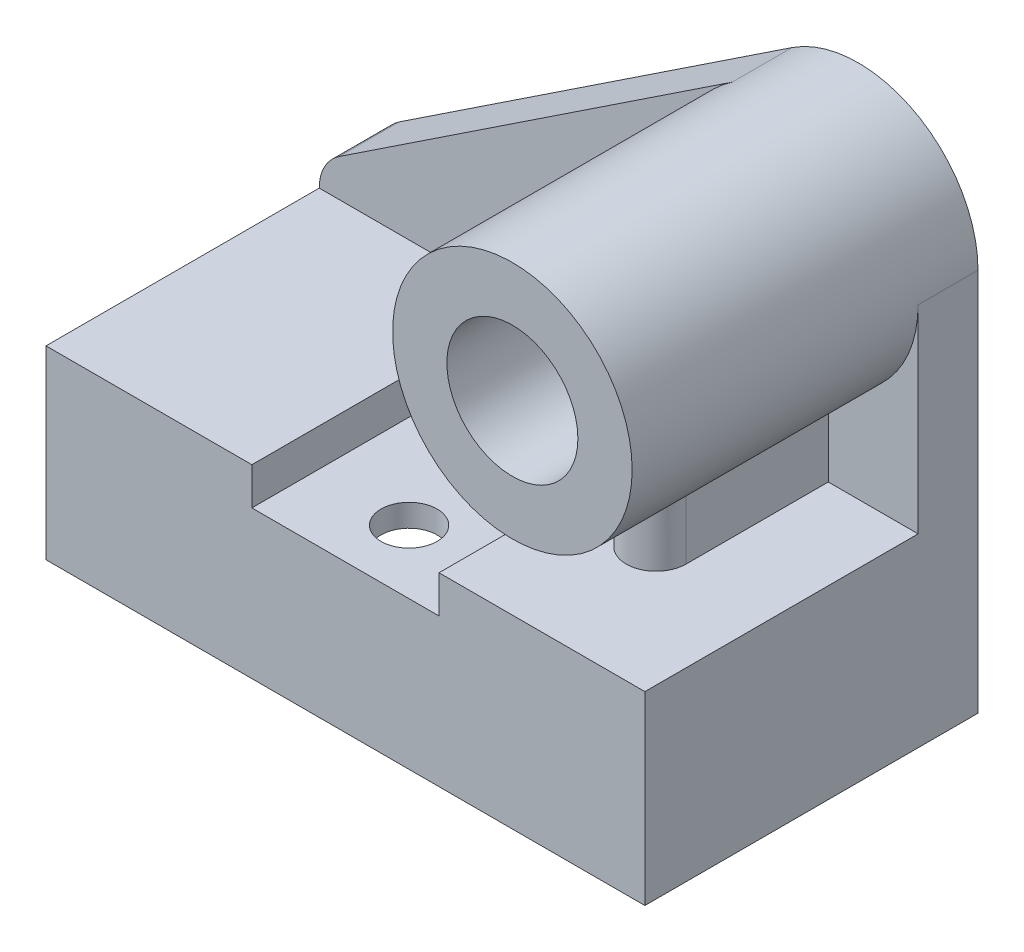
ISO-10303-21;
HEADER;
FILE_DESCRIPTION(('STEP AP214'),'2;1');
FILE_NAME('part.step','',(''),(''),'','','');
FILE_SCHEMA(('AUTOMOTIVE_DESIGN { 1 0 10303 214 1 1 1 1 }'));
ENDSEC;
DATA;
#1=APPLICATION_CONTEXT('core data for automotive mechanical design processes');
#2=APPLICATION_PROTOCOL_DEFINITION('international standard','automotive_design',2000,#1);
#3=PRODUCT_CONTEXT('',#1,'mechanical');
#4=PRODUCT('Part','Part','',(#3));
#5=PRODUCT_RELATED_PRODUCT_CATEGORY('part','',(#4));
#6=PRODUCT_DEFINITION_FORMATION('','',#4);
#7=PRODUCT_DEFINITION_CONTEXT('part definition',#1,'design');
#8=PRODUCT_DEFINITION('design','',#6,#7);
#9=PRODUCT_DEFINITION_SHAPE('','',#8);
#10=(LENGTH_UNIT() NAMED_UNIT(*) SI_UNIT(.MILLI.,.METRE.));
#11=(NAMED_UNIT(*) PLANE_ANGLE_UNIT() SI_UNIT($,.RADIAN.));
#12=(NAMED_UNIT(*) SI_UNIT($,.STERADIAN.) SOLID_ANGLE_UNIT());
#13=UNCERTAINTY_MEASURE_WITH_UNIT(LENGTH_MEASURE(1.E-05),#10,'distance_accuracy_value','');
#14=(GEOMETRIC_REPRESENTATION_CONTEXT(3) GLOBAL_UNCERTAINTY_ASSIGNED_CONTEXT((#13)) GLOBAL_UNIT_ASSIGNED_CONTEXT((#10,
#11,#12)) REPRESENTATION_CONTEXT('',''));
#15=CARTESIAN_POINT('',(0.,0.,0.));
#16=DIRECTION('',(0.,0.,1.));
#17=DIRECTION('',(1.,0.,0.));
#18=AXIS2_PLACEMENT_3D('',#15,#16,#17);
#19=CARTESIAN_POINT('',(-32.,102.5,92.4));
#20=DIRECTION('',(0.,0.,-1.));
#21=DIRECTION('',(-1.,0.,0.));
#22=AXIS2_PLACEMENT_3D('',#19,#20,#21);
#23=CYLINDRICAL_SURFACE('',#22,32.);
#24=CARTESIAN_POINT('',(-32.,102.5,92.4));
#25=DIRECTION('',(0.,0.,1.));
#26=DIRECTION('',(1.,0.,0.));
#27=AXIS2_PLACEMENT_3D('',#24,#25,#26);
#28=CIRCLE('',#27,32.);
#29=CARTESIAN_POINT('',(0.,102.5,92.4));
#30=VERTEX_POINT('',#29);
#31=EDGE_CURVE('E11',#30,#30,#28,.T.);
#32=ORIENTED_EDGE('',*,*,#31,.F.);
#33=EDGE_LOOP('',(#32));
#34=FACE_BOUND('',#33,.T.);
#35=DIRECTION('',(0.,0.,-1.));
#36=VECTOR('',#35,1.);
#37=CARTESIAN_POINT('',(-49.6982450307983,129.160309878728,16.));
#38=LINE('',#37,#36);
#39=CARTESIAN_POINT('',(-49.6982450307983,129.160309878728,16.));
#40=VERTEX_POINT('',#39);
#41=CARTESIAN_POINT('',(-49.6982450307983,129.160309878728,0.));
#42=VERTEX_POINT('',#41);
#43=EDGE_CURVE('E56',#40,#42,#38,.T.);
#44=ORIENTED_EDGE('',*,*,#43,.F.);
#45=CARTESIAN_POINT('',(-32.,102.5,16.));
#46=DIRECTION('',(0.,0.,1.));
#47=DIRECTION('',(1.,0.,0.));
#48=AXIS2_PLACEMENT_3D('',#45,#46,#47);
#49=CIRCLE('',#48,32.);
#50=CARTESIAN_POINT('',(-40.,71.5161332303407,16.));
#51=VERTEX_POINT('',#50);
#52=EDGE_CURVE('E60',#40,#51,#49,.T.);
#53=ORIENTED_EDGE('',*,*,#52,.T.);
#54=DIRECTION('',(0.,0.,-1.));
#55=VECTOR('',#54,1.);
#56=CARTESIAN_POINT('',(-40.,71.5161332303407,92.4));
#57=LINE('',#56,#55);
#58=CARTESIAN_POINT('',(-40.,71.5161332303611,54.));
#59=VERTEX_POINT('',#58);
#60=EDGE_CURVE('E260',#51,#59,#57,.F.);
#61=ORIENTED_EDGE('',*,*,#60,.T.);
#62=CARTESIAN_POINT('',(-40.,71.5161332303611,54.));
#63=CARTESIAN_POINT('',(-40.0000280544337,71.516158745682,54.2212367206058));
#64=CARTESIAN_POINT('',(-39.9908239351687,71.5137645196414,54.4424645268475));
#65=CARTESIAN_POINT('',(-39.9541576891331,71.5043223033306,54.8832658540761));
#66=CARTESIAN_POINT('',(-39.9266986346481,71.4972750961532,55.1028396471438));
#67=CARTESIAN_POINT('',(-39.8538008083666,71.4787308558009,55.538341411734));
#68=CARTESIAN_POINT('',(-39.8083976637214,71.4672426410215,55.7542757288307));
#69=CARTESIAN_POINT('',(-39.6999971091686,71.4401676916371,56.1814188182674));
#70=CARTESIAN_POINT('',(-39.636999457304,71.4245809006693,56.3926275255785));
#71=CARTESIAN_POINT('',(-39.4939356762478,71.3897712214484,56.8087955476442));
#72=CARTESIAN_POINT('',(-39.4138748988318,71.3705494734963,57.0137567989004));
#73=CARTESIAN_POINT('',(-39.2372546288073,71.3290139022866,57.4162045984616));
#74=CARTESIAN_POINT('',(-39.140689036432,71.3066989364313,57.6136883501899));
#75=CARTESIAN_POINT('',(-38.9317805865998,71.2596114504409,57.9998258652688));
#76=CARTESIAN_POINT('',(-38.8194371413712,71.2348388387614,58.1884792993148));
#77=CARTESIAN_POINT('',(-38.5797532806097,71.1835209139501,58.5557585768954));
#78=CARTESIAN_POINT('',(-38.4524122001394,71.1569755222427,58.7343839753067));
#79=CARTESIAN_POINT('',(-38.1809363558274,71.1022999736736,59.0838909661983));
#80=CARTESIAN_POINT('',(-38.0365203413901,71.0741489065014,59.2545508902197));
#81=CARTESIAN_POINT('',(-37.7339467017269,71.0175360184009,59.5831659166973));
#82=CARTESIAN_POINT('',(-37.5757889067169,70.9890741936369,59.7411208621329));
#83=CARTESIAN_POINT('',(-37.2467396218354,70.9326183126732,60.0433127794055));
#84=CARTESIAN_POINT('',(-37.0758459377881,70.9046243380978,60.1875473776721));
#85=CARTESIAN_POINT('',(-36.7224652126531,70.8498770188942,60.461290458239));
#86=CARTESIAN_POINT('',(-36.5399784852511,70.8231236407318,60.5907993387247));
#87=CARTESIAN_POINT('',(-36.1619325333859,70.7712239960298,60.8359186007419));
#88=CARTESIAN_POINT('',(-35.9662245759876,70.7461059150704,60.9513057318813));
#89=CARTESIAN_POINT('',(-35.5655134570821,70.6986195421177,61.1651004045434));
#90=CARTESIAN_POINT('',(-35.3605136652597,70.6762502640209,61.2635140402682));
#91=CARTESIAN_POINT('',(-34.9425827474529,70.634889048357,61.4426403045277));
#92=CARTESIAN_POINT('',(-34.7296514424177,70.6158971870897,61.5233525331767));
#93=CARTESIAN_POINT('',(-34.2973992920391,70.5818398364787,61.6664058886466));
#94=CARTESIAN_POINT('',(-34.0780785956853,70.566774255662,61.7287474434642));
#95=CARTESIAN_POINT('',(-33.6391620499081,70.5412689566385,61.8334549460496));
#96=CARTESIAN_POINT('',(-33.4196616021837,70.5307417887523,61.8761996351205));
#97=CARTESIAN_POINT('',(-32.9776884633137,70.5141746551768,61.9431781232991));
#98=CARTESIAN_POINT('',(-32.7552158372076,70.5081345914603,61.9674123267952));
#99=CARTESIAN_POINT('',(-32.3089675426713,70.5007135691066,61.9971582510348));
#100=CARTESIAN_POINT('',(-32.085192009084,70.4993321366233,62.0026718759161));
#101=CARTESIAN_POINT('',(-31.637987545708,70.5012665346051,61.9949332711412));
#102=CARTESIAN_POINT('',(-31.4145586116507,70.5045823067545,61.9816812744597));
#103=CARTESIAN_POINT('',(-30.9747001518449,70.5156901447709,61.9370353075323));
#104=CARTESIAN_POINT('',(-30.7582259623917,70.5233802543781,61.9060544622544));
#105=CARTESIAN_POINT('',(-30.3286493946472,70.5429533028099,61.8265138220336));
#106=CARTESIAN_POINT('',(-30.1155481814017,70.5548376586973,61.7779480857372));
#107=CARTESIAN_POINT('',(-29.6943374596585,70.5824741604891,61.6636496834091));
#108=CARTESIAN_POINT('',(-29.4862263087893,70.5982250140931,61.5979227527013));
#109=CARTESIAN_POINT('',(-29.0762467862461,70.6331831779632,61.4497781070814));
#110=CARTESIAN_POINT('',(-28.8743807820437,70.6523917806588,61.3673541497441));
#111=CARTESIAN_POINT('',(-28.4765754723538,70.6939341672795,61.1856600001906));
#112=CARTESIAN_POINT('',(-28.2807028117609,70.7162936282113,61.0862498056194));
#113=CARTESIAN_POINT('',(-27.8979434976561,70.7634227888494,60.8717739246116));
#114=CARTESIAN_POINT('',(-27.7110599694918,70.7881933179155,60.7567028456821));
#115=CARTESIAN_POINT('',(-27.3475457426236,70.8394825314385,60.5117359543025));
#116=CARTESIAN_POINT('',(-27.1709145359932,70.8660011291524,60.3818408772191));
#117=CARTESIAN_POINT('',(-26.8289984385661,70.9200901205802,60.1080854429683));
#118=CARTESIAN_POINT('',(-26.6637137727223,70.9476605351305,59.9642248090607));
#119=CARTESIAN_POINT('',(-26.3412000317921,71.003881125021,59.6593768187564));
#120=CARTESIAN_POINT('',(-26.1843117261326,71.0325402875742,59.4980303916783));
#121=CARTESIAN_POINT('',(-25.8846941538753,71.089392158551,59.1627097005253));
#122=CARTESIAN_POINT('',(-25.7419602168071,71.1175850182635,58.9887396348636));
#123=CARTESIAN_POINT('',(-25.4714768375941,71.1727362384378,58.6291503654458));
#124=CARTESIAN_POINT('',(-25.3437371476937,71.1996937885842,58.4435236993857));
#125=CARTESIAN_POINT('',(-25.1043016690472,71.2515704281193,58.0620243779298));
#126=CARTESIAN_POINT('',(-24.9925997067108,71.2764903002964,57.8661557049331));
#127=CARTESIAN_POINT('',(-24.7854078774411,71.3237105639005,57.4642558402384));
#128=CARTESIAN_POINT('',(-24.6900160490465,71.3459948823797,57.2581721820048));
#129=CARTESIAN_POINT('',(-24.5170290029085,71.3870918818633,56.8384239105144));
#130=CARTESIAN_POINT('',(-24.4394266834676,71.405905947629,56.6247623618769));
#131=CARTESIAN_POINT('',(-24.302684208487,71.4394737900285,56.1915453546083));
#132=CARTESIAN_POINT('',(-24.2435249358262,71.4542317691029,55.9719962568803));
#133=CARTESIAN_POINT('',(-24.1440918012067,71.4792435266469,55.5285021173662));
#134=CARTESIAN_POINT('',(-24.1038090916045,71.4894994151509,55.3045591864006));
#135=CARTESIAN_POINT('',(-24.0487808623285,71.503568496023,54.90038804313));
#136=CARTESIAN_POINT('',(-24.0304826367573,71.5082740323943,54.7206658998328));
#137=CARTESIAN_POINT('',(-24.0060969884818,71.5145591208553,54.3606341934799));
#138=CARTESIAN_POINT('',(-23.9999898098604,71.5161437304345,54.1803260558676));
#139=CARTESIAN_POINT('',(-24.,71.5161332303407,53.9999999999993));
#140=B_SPLINE_CURVE_WITH_KNOTS('',3,(#62,#63,#64,#65,#66,#67,#68,#69,#70,#71,#72,#73,#74,#75,
#76,#77,#78,#79,#80,#81,#82,#83,#84,#85,#86,#87,#88,#89,#90,#91,#92,#93,#94,#95,#96,#97,#98,#99,
#100,#101,#102,#103,#104,#105,#106,#107,#108,#109,#110,#111,#112,#113,#114,#115,#116,#117,#118,
#119,#120,#121,#122,#123,#124,#125,#126,#127,#128,#129,#130,#131,#132,#133,#134,#135,#136,#137,
#138,#139),.UNSPECIFIED.,.F.,.F.,(4,2,2,2,2,2,2,2,2,2,2,2,2,2,2,2,2,2,2,2,2,2,2,2,2,2,2,2,2,2,2,
2,2,2,2,2,2,2,4),(0.,0.663492242717754,1.32687284867662,1.98894290744224,2.65102207134075,
3.31289388176644,3.97501083448075,4.63715245955544,5.29932345249751,5.97452992833415,
6.64974474775131,7.32507616525506,8.00038931735198,8.68528336807323,9.36993099864893,
10.0545940942485,10.7392412374291,11.4100321538676,12.0808084154889,12.7515164479815,
13.4222161537266,14.0778887695744,14.7337831225543,15.3894585535814,16.0453795722873,
16.7069934346376,17.3688356887719,18.0306451254819,18.6924676792265,19.372267461451,
20.0518421807395,20.7318564740573,21.4116082956317,22.0953124116701,22.7787431110354,
23.4614630273386,24.143862624779,24.6855747194271,25.2264082401843),.UNSPECIFIED.);
#141=CARTESIAN_POINT('',(-24.,71.5161332303407,54.));
#142=VERTEX_POINT('',#141);
#143=EDGE_CURVE('E245',#59,#142,#140,.T.);
#144=ORIENTED_EDGE('',*,*,#143,.T.);
#145=DIRECTION('',(0.,0.,-1.));
#146=VECTOR('',#145,1.);
#147=CARTESIAN_POINT('',(-24.,71.5161332303407,92.4));
#148=LINE('',#147,#146);
#149=CARTESIAN_POINT('',(-24.,71.5161332303407,16.));
#150=VERTEX_POINT('',#149);
#151=EDGE_CURVE('E256',#150,#142,#148,.F.);
#152=ORIENTED_EDGE('',*,*,#151,.F.);
#153=CARTESIAN_POINT('',(0.,102.5,16.));
#154=VERTEX_POINT('',#153);
#155=EDGE_CURVE('E232',#150,#154,#49,.T.);
#156=ORIENTED_EDGE('',*,*,#155,.T.);
#157=DIRECTION('',(0.,0.,-1.));
#158=VECTOR('',#157,1.);
#159=CARTESIAN_POINT('',(0.,102.5,16.));
#160=LINE('',#159,#158);
#161=CARTESIAN_POINT('',(0.,102.5,0.));
#162=VERTEX_POINT('',#161);
#163=EDGE_CURVE('E228',#154,#162,#160,.T.);
#164=ORIENTED_EDGE('',*,*,#163,.T.);
#165=CARTESIAN_POINT('',(-32.,102.5,0.));
#166=DIRECTION('',(0.,0.,1.));
#167=DIRECTION('',(1.,0.,0.));
#168=AXIS2_PLACEMENT_3D('',#165,#166,#167);
#169=CIRCLE('',#168,32.);
#170=EDGE_CURVE('E43',#162,#42,#169,.T.);
#171=ORIENTED_EDGE('',*,*,#170,.T.);
#172=EDGE_LOOP('',(#44,#53,#61,#144,#152,#156,#164,#171));
#173=FACE_BOUND('',#172,.T.);
#174=ADVANCED_FACE('F39',(#34,#173),#23,.T.);
#175=CARTESIAN_POINT('',(-32.,102.5,92.4));
#176=DIRECTION('',(0.,0.,-1.));
#177=DIRECTION('',(-1.,0.,0.));
#178=AXIS2_PLACEMENT_3D('',#175,#176,#177);
#179=CYLINDRICAL_SURFACE('',#178,17.5);
#180=CARTESIAN_POINT('',(-32.,102.5,92.4));
#181=DIRECTION('',(0.,0.,1.));
#182=DIRECTION('',(1.,0.,0.));
#183=AXIS2_PLACEMENT_3D('',#180,#181,#182);
#184=CIRCLE('',#183,17.5);
#185=CARTESIAN_POINT('',(-14.5,102.5,92.4));
#186=VERTEX_POINT('',#185);
#187=EDGE_CURVE('E48',#186,#186,#184,.T.);
#188=ORIENTED_EDGE('',*,*,#187,.T.);
#189=EDGE_LOOP('',(#188));
#190=FACE_BOUND('',#189,.T.);
#191=CARTESIAN_POINT('',(-32.,102.5,0.));
#192=DIRECTION('',(0.,0.,1.));
#193=DIRECTION('',(1.,0.,0.));
#194=AXIS2_PLACEMENT_3D('',#191,#192,#193);
#195=CIRCLE('',#194,17.5);
#196=CARTESIAN_POINT('',(-14.5,102.5,0.));
#197=VERTEX_POINT('',#196);
#198=EDGE_CURVE('E531',#197,#197,#195,.T.);
#199=ORIENTED_EDGE('',*,*,#198,.F.);
#200=EDGE_LOOP('',(#199));
#201=FACE_BOUND('',#200,.T.);
#202=ADVANCED_FACE('F41',(#190,#201),#179,.F.);
#203=CARTESIAN_POINT('',(0.,0.,92.4));
#204=DIRECTION('',(0.,0.,1.));
#205=DIRECTION('',(1.,0.,0.));
#206=AXIS2_PLACEMENT_3D('',#203,#204,#205);
#207=PLANE('',#206);
#208=ORIENTED_EDGE('',*,*,#187,.F.);
#209=EDGE_LOOP('',(#208));
#210=FACE_BOUND('',#209,.T.);
#211=ORIENTED_EDGE('',*,*,#31,.T.);
#212=EDGE_LOOP('',(#211));
#213=FACE_BOUND('',#212,.T.);
#214=ADVANCED_FACE('F299',(#210,#213),#207,.T.);
#215=CARTESIAN_POINT('',(0.,0.,0.));
#216=DIRECTION('',(0.,0.,1.));
#217=DIRECTION('',(1.,0.,0.));
#218=AXIS2_PLACEMENT_3D('',#215,#216,#217);
#219=PLANE('',#218);
#220=ORIENTED_EDGE('',*,*,#198,.T.);
#221=EDGE_LOOP('',(#220));
#222=FACE_BOUND('',#221,.T.);
#223=ORIENTED_EDGE('',*,*,#170,.F.);
#224=DIRECTION('',(0.,1.,0.));
#225=VECTOR('',#224,1.);
#226=CARTESIAN_POINT('',(0.,0.,0.));
#227=LINE('',#226,#225);
#228=CARTESIAN_POINT('',(0.,0.,0.));
#229=VERTEX_POINT('',#228);
#230=EDGE_CURVE('E521',#229,#162,#227,.T.);
#231=ORIENTED_EDGE('',*,*,#230,.F.);
#232=DIRECTION('',(-1.,0.,0.));
#233=VECTOR('',#232,1.);
#234=CARTESIAN_POINT('',(0.,0.,0.));
#235=LINE('',#234,#233);
#236=CARTESIAN_POINT('',(-160.,0.,0.));
#237=VERTEX_POINT('',#236);
#238=EDGE_CURVE('E518',#229,#237,#235,.T.);
#239=ORIENTED_EDGE('',*,*,#238,.T.);
#240=DIRECTION('',(0.,1.,0.));
#241=VECTOR('',#240,1.);
#242=CARTESIAN_POINT('',(-160.,0.,0.));
#243=LINE('',#242,#241);
#244=CARTESIAN_POINT('',(-160.,49.5,0.));
#245=VERTEX_POINT('',#244);
#246=EDGE_CURVE('E495',#237,#245,#243,.T.);
#247=ORIENTED_EDGE('',*,*,#246,.T.);
#248=CARTESIAN_POINT('',(-148.,49.5,0.));
#249=DIRECTION('',(0.,0.,1.));
#250=DIRECTION('',(1.,0.,0.));
#251=AXIS2_PLACEMENT_3D('',#248,#249,#250);
#252=CIRCLE('',#251,12.);
#253=CARTESIAN_POINT('',(-154.636841886549,59.4976162045231,0.));
#254=VERTEX_POINT('',#253);
#255=EDGE_CURVE('E230',#245,#254,#252,.F.);
#256=ORIENTED_EDGE('',*,*,#255,.T.);
#257=DIRECTION('',(0.833134683710262,0.553070157212447,0.));
#258=VECTOR('',#257,1.);
#259=CARTESIAN_POINT('',(-74.716764068491,112.551955277792,0.));
#260=LINE('',#259,#258);
#261=EDGE_CURVE('E202',#254,#42,#260,.T.);
#262=ORIENTED_EDGE('',*,*,#261,.T.);
#263=EDGE_LOOP('',(#223,#231,#239,#247,#256,#262));
#264=FACE_BOUND('',#263,.T.);
#265=ADVANCED_FACE('F303',(#222,#264),#219,.F.);
#266=CARTESIAN_POINT('',(0.,49.5,89.));
#267=DIRECTION('',(0.,1.,0.));
#268=DIRECTION('',(-1.,0.,0.));
#269=AXIS2_PLACEMENT_3D('',#266,#267,#268);
#270=PLANE('',#269);
#271=DIRECTION('',(1.,0.,0.));
#272=VECTOR('',#271,1.);
#273=CARTESIAN_POINT('',(0.,49.5,16.));
#274=LINE('',#273,#272);
#275=CARTESIAN_POINT('',(-160.,49.5,16.));
#276=VERTEX_POINT('',#275);
#277=CARTESIAN_POINT('',(-40.,49.5,16.));
#278=VERTEX_POINT('',#277);
#279=EDGE_CURVE('E221',#276,#278,#274,.T.);
#280=ORIENTED_EDGE('',*,*,#279,.F.);
#281=DIRECTION('',(0.,0.,-1.));
#282=VECTOR('',#281,1.);
#283=CARTESIAN_POINT('',(-160.,49.5,89.));
#284=LINE('',#283,#282);
#285=CARTESIAN_POINT('',(-160.,49.5,89.));
#286=VERTEX_POINT('',#285);
#287=EDGE_CURVE('E528',#286,#276,#284,.T.);
#288=ORIENTED_EDGE('',*,*,#287,.F.);
#289=DIRECTION('',(1.,0.,0.));
#290=VECTOR('',#289,1.);
#291=CARTESIAN_POINT('',(0.,49.5,89.));
#292=LINE('',#291,#290);
#293=CARTESIAN_POINT('',(-105.,49.5,89.));
#294=VERTEX_POINT('',#293);
#295=EDGE_CURVE('E502',#286,#294,#292,.T.);
#296=ORIENTED_EDGE('',*,*,#295,.T.);
#297=DIRECTION('',(0.,0.,-1.));
#298=VECTOR('',#297,1.);
#299=CARTESIAN_POINT('',(-105.,49.5,0.));
#300=LINE('',#299,#298);
#301=CARTESIAN_POINT('',(-105.,49.5,35.));
#302=VERTEX_POINT('',#301);
#303=EDGE_CURVE('E476',#294,#302,#300,.T.);
#304=ORIENTED_EDGE('',*,*,#303,.T.);
#305=DIRECTION('',(1.,0.,0.));
#306=VECTOR('',#305,1.);
#307=CARTESIAN_POINT('',(0.,49.5,35.));
#308=LINE('',#307,#306);
#309=CARTESIAN_POINT('',(-55.,49.5,35.));
#310=VERTEX_POINT('',#309);
#311=EDGE_CURVE('E487',#302,#310,#308,.T.);
#312=ORIENTED_EDGE('',*,*,#311,.T.);
#313=DIRECTION('',(0.,0.,-1.));
#314=VECTOR('',#313,1.);
#315=CARTESIAN_POINT('',(-55.,49.5,0.));
#316=LINE('',#315,#314);
#317=CARTESIAN_POINT('',(-55.,49.5,89.));
#318=VERTEX_POINT('',#317);
#319=EDGE_CURVE('E435',#318,#310,#316,.T.);
#320=ORIENTED_EDGE('',*,*,#319,.F.);
#321=CARTESIAN_POINT('',(0.,49.5,89.));
#322=VERTEX_POINT('',#321);
#323=EDGE_CURVE('E506',#318,#322,#292,.T.);
#324=ORIENTED_EDGE('',*,*,#323,.T.);
#325=DIRECTION('',(0.,0.,-1.));
#326=VECTOR('',#325,1.);
#327=CARTESIAN_POINT('',(0.,49.5,89.));
#328=LINE('',#327,#326);
#329=CARTESIAN_POINT('',(0.,49.5,16.));
#330=VERTEX_POINT('',#329);
#331=EDGE_CURVE('E515',#322,#330,#328,.T.);
#332=ORIENTED_EDGE('',*,*,#331,.T.);
#333=CARTESIAN_POINT('',(-24.,49.5,16.));
#334=VERTEX_POINT('',#333);
#335=EDGE_CURVE('E218',#334,#330,#274,.T.);
#336=ORIENTED_EDGE('',*,*,#335,.F.);
#337=DIRECTION('',(0.,0.,1.));
#338=VECTOR('',#337,1.);
#339=CARTESIAN_POINT('',(-24.,49.5,0.));
#340=LINE('',#339,#338);
#341=CARTESIAN_POINT('',(-24.,49.5,54.));
#342=VERTEX_POINT('',#341);
#343=EDGE_CURVE('E246',#334,#342,#340,.T.);
#344=ORIENTED_EDGE('',*,*,#343,.T.);
#345=CARTESIAN_POINT('',(-32.,49.5,54.));
#346=DIRECTION('',(0.,1.,0.));
#347=DIRECTION('',(-1.,0.,0.));
#348=AXIS2_PLACEMENT_3D('',#345,#346,#347);
#349=CIRCLE('',#348,8.);
#350=CARTESIAN_POINT('',(-40.,49.5,54.));
#351=VERTEX_POINT('',#350);
#352=EDGE_CURVE('E248',#351,#342,#349,.T.);
#353=ORIENTED_EDGE('',*,*,#352,.F.);
#354=DIRECTION('',(0.,0.,1.));
#355=VECTOR('',#354,1.);
#356=CARTESIAN_POINT('',(-40.,49.5,0.));
#357=LINE('',#356,#355);
#358=EDGE_CURVE('E252',#278,#351,#357,.T.);
#359=ORIENTED_EDGE('',*,*,#358,.F.);
#360=EDGE_LOOP('',(#280,#288,#296,#304,#312,#320,#324,#332,#336,#344,#353,#359));
#361=FACE_BOUND('',#360,.T.);
#362=ADVANCED_FACE('F306',(#361),#270,.T.);
#363=CARTESIAN_POINT('',(0.,0.,89.));
#364=DIRECTION('',(0.,-1.,0.));
#365=DIRECTION('',(1.,0.,0.));
#366=AXIS2_PLACEMENT_3D('',#363,#364,#365);
#367=PLANE('',#366);
#368=ORIENTED_EDGE('',*,*,#238,.F.);
#369=DIRECTION('',(0.,0.,-1.));
#370=VECTOR('',#369,1.);
#371=CARTESIAN_POINT('',(0.,0.,89.));
#372=LINE('',#371,#370);
#373=CARTESIAN_POINT('',(0.,0.,89.));
#374=VERTEX_POINT('',#373);
#375=EDGE_CURVE('E524',#374,#229,#372,.T.);
#376=ORIENTED_EDGE('',*,*,#375,.F.);
#377=DIRECTION('',(-1.,0.,0.));
#378=VECTOR('',#377,1.);
#379=CARTESIAN_POINT('',(0.,0.,89.));
#380=LINE('',#379,#378);
#381=CARTESIAN_POINT('',(-160.,0.,89.));
#382=VERTEX_POINT('',#381);
#383=EDGE_CURVE('E509',#374,#382,#380,.T.);
#384=ORIENTED_EDGE('',*,*,#383,.T.);
#385=DIRECTION('',(0.,0.,-1.));
#386=VECTOR('',#385,1.);
#387=CARTESIAN_POINT('',(-160.,0.,89.));
#388=LINE('',#387,#386);
#389=EDGE_CURVE('E526',#382,#237,#388,.T.);
#390=ORIENTED_EDGE('',*,*,#389,.T.);
#391=EDGE_LOOP('',(#368,#376,#384,#390));
#392=FACE_BOUND('',#391,.T.);
#393=DIRECTION('',(0.,0.,-1.));
#394=VECTOR('',#393,1.);
#395=CARTESIAN_POINT('',(-6.,0.,89.));
#396=LINE('',#395,#394);
#397=CARTESIAN_POINT('',(-6.,0.,83.));
#398=VERTEX_POINT('',#397);
#399=CARTESIAN_POINT('',(-6.,0.,6.));
#400=VERTEX_POINT('',#399);
#401=EDGE_CURVE('E426',#398,#400,#396,.T.);
#402=ORIENTED_EDGE('',*,*,#401,.T.);
#403=DIRECTION('',(-1.,0.,0.));
#404=VECTOR('',#403,1.);
#405=CARTESIAN_POINT('',(0.,0.,6.00000000000001));
#406=LINE('',#405,#404);
#407=CARTESIAN_POINT('',(-154.,0.,6.));
#408=VERTEX_POINT('',#407);
#409=EDGE_CURVE('E454',#400,#408,#406,.T.);
#410=ORIENTED_EDGE('',*,*,#409,.T.);
#411=DIRECTION('',(0.,0.,-1.));
#412=VECTOR('',#411,1.);
#413=CARTESIAN_POINT('',(-154.,0.,89.));
#414=LINE('',#413,#412);
#415=CARTESIAN_POINT('',(-154.,0.,83.));
#416=VERTEX_POINT('',#415);
#417=EDGE_CURVE('E436',#416,#408,#414,.T.);
#418=ORIENTED_EDGE('',*,*,#417,.F.);
#419=DIRECTION('',(-1.,0.,0.));
#420=VECTOR('',#419,1.);
#421=CARTESIAN_POINT('',(0.,0.,83.));
#422=LINE('',#421,#420);
#423=EDGE_CURVE('E445',#398,#416,#422,.T.);
#424=ORIENTED_EDGE('',*,*,#423,.F.);
#425=EDGE_LOOP('',(#402,#410,#418,#424));
#426=FACE_BOUND('',#425,.T.);
#427=ADVANCED_FACE('F313',(#392,#426),#367,.T.);
#428=CARTESIAN_POINT('',(0.,0.,89.));
#429=DIRECTION('',(0.,0.,1.));
#430=DIRECTION('',(1.,0.,0.));
#431=AXIS2_PLACEMENT_3D('',#428,#429,#430);
#432=PLANE('',#431);
#433=DIRECTION('',(1.,0.,0.));
#434=VECTOR('',#433,1.);
#435=CARTESIAN_POINT('',(0.,39.5,89.));
#436=LINE('',#435,#434);
#437=CARTESIAN_POINT('',(-105.,39.5,89.));
#438=VERTEX_POINT('',#437);
#439=CARTESIAN_POINT('',(-55.,39.5,89.));
#440=VERTEX_POINT('',#439);
#441=EDGE_CURVE('E472',#438,#440,#436,.T.);
#442=ORIENTED_EDGE('',*,*,#441,.F.);
#443=DIRECTION('',(0.,1.,0.));
#444=VECTOR('',#443,1.);
#445=CARTESIAN_POINT('',(-105.,39.5,89.));
#446=LINE('',#445,#444);
#447=EDGE_CURVE('E492',#438,#294,#446,.T.);
#448=ORIENTED_EDGE('',*,*,#447,.T.);
#449=ORIENTED_EDGE('',*,*,#295,.F.);
#450=DIRECTION('',(0.,1.,0.));
#451=VECTOR('',#450,1.);
#452=CARTESIAN_POINT('',(-160.,0.,89.));
#453=LINE('',#452,#451);
#454=EDGE_CURVE('E505',#382,#286,#453,.T.);
#455=ORIENTED_EDGE('',*,*,#454,.F.);
#456=ORIENTED_EDGE('',*,*,#383,.F.);
#457=DIRECTION('',(0.,1.,0.));
#458=VECTOR('',#457,1.);
#459=CARTESIAN_POINT('',(0.,0.,89.));
#460=LINE('',#459,#458);
#461=EDGE_CURVE('E512',#374,#322,#460,.T.);
#462=ORIENTED_EDGE('',*,*,#461,.T.);
#463=ORIENTED_EDGE('',*,*,#323,.F.);
#464=DIRECTION('',(0.,1.,0.));
#465=VECTOR('',#464,1.);
#466=CARTESIAN_POINT('',(-55.,39.5,89.));
#467=LINE('',#466,#465);
#468=EDGE_CURVE('E484',#440,#318,#467,.T.);
#469=ORIENTED_EDGE('',*,*,#468,.F.);
#470=EDGE_LOOP('',(#442,#448,#449,#455,#456,#462,#463,#469));
#471=FACE_BOUND('',#470,.T.);
#472=ADVANCED_FACE('F319',(#471),#432,.T.);
#473=CARTESIAN_POINT('',(-160.,0.,89.));
#474=DIRECTION('',(-1.,0.,0.));
#475=DIRECTION('',(0.,0.,1.));
#476=AXIS2_PLACEMENT_3D('',#473,#474,#475);
#477=PLANE('',#476);
#478=ORIENTED_EDGE('',*,*,#246,.F.);
#479=ORIENTED_EDGE('',*,*,#389,.F.);
#480=ORIENTED_EDGE('',*,*,#454,.T.);
#481=ORIENTED_EDGE('',*,*,#287,.T.);
#482=DIRECTION('',(0.,0.,-1.));
#483=VECTOR('',#482,1.);
#484=CARTESIAN_POINT('',(-160.,49.5,16.));
#485=LINE('',#484,#483);
#486=EDGE_CURVE('E207',#276,#245,#485,.T.);
#487=ORIENTED_EDGE('',*,*,#486,.T.);
#488=EDGE_LOOP('',(#478,#479,#480,#481,#487));
#489=FACE_BOUND('',#488,.T.);
#490=ADVANCED_FACE('F315',(#489),#477,.T.);
#491=CARTESIAN_POINT('',(0.,0.,89.));
#492=DIRECTION('',(-1.,0.,0.));
#493=DIRECTION('',(0.,0.,1.));
#494=AXIS2_PLACEMENT_3D('',#491,#492,#493);
#495=PLANE('',#494);
#496=ORIENTED_EDGE('',*,*,#230,.T.);
#497=ORIENTED_EDGE('',*,*,#163,.F.);
#498=DIRECTION('',(0.,1.,0.));
#499=VECTOR('',#498,1.);
#500=CARTESIAN_POINT('',(0.,0.,16.));
#501=LINE('',#500,#499);
#502=EDGE_CURVE('E225',#330,#154,#501,.T.);
#503=ORIENTED_EDGE('',*,*,#502,.F.);
#504=ORIENTED_EDGE('',*,*,#331,.F.);
#505=ORIENTED_EDGE('',*,*,#461,.F.);
#506=ORIENTED_EDGE('',*,*,#375,.T.);
#507=EDGE_LOOP('',(#496,#497,#503,#504,#505,#506));
#508=FACE_BOUND('',#507,.T.);
#509=ADVANCED_FACE('F318',(#508),#495,.F.);
#510=CARTESIAN_POINT('',(-105.,39.5,0.));
#511=DIRECTION('',(1.,0.,0.));
#512=DIRECTION('',(0.,1.,0.));
#513=AXIS2_PLACEMENT_3D('',#510,#511,#512);
#514=PLANE('',#513);
#515=ORIENTED_EDGE('',*,*,#303,.F.);
#516=ORIENTED_EDGE('',*,*,#447,.F.);
#517=DIRECTION('',(0.,0.,-1.));
#518=VECTOR('',#517,1.);
#519=CARTESIAN_POINT('',(-105.,39.5,0.));
#520=LINE('',#519,#518);
#521=CARTESIAN_POINT('',(-105.,39.5,35.));
#522=VERTEX_POINT('',#521);
#523=EDGE_CURVE('E481',#438,#522,#520,.T.);
#524=ORIENTED_EDGE('',*,*,#523,.T.);
#525=DIRECTION('',(0.,1.,0.));
#526=VECTOR('',#525,1.);
#527=CARTESIAN_POINT('',(-105.,39.5,35.));
#528=LINE('',#527,#526);
#529=EDGE_CURVE('E496',#522,#302,#528,.T.);
#530=ORIENTED_EDGE('',*,*,#529,.T.);
#531=EDGE_LOOP('',(#515,#516,#524,#530));
#532=FACE_BOUND('',#531,.T.);
#533=ADVANCED_FACE('F326',(#532),#514,.T.);
#534=CARTESIAN_POINT('',(0.,39.5,35.));
#535=DIRECTION('',(0.,0.,1.));
#536=DIRECTION('',(1.,0.,0.));
#537=AXIS2_PLACEMENT_3D('',#534,#535,#536);
#538=PLANE('',#537);
#539=ORIENTED_EDGE('',*,*,#311,.F.);
#540=ORIENTED_EDGE('',*,*,#529,.F.);
#541=DIRECTION('',(1.,0.,0.));
#542=VECTOR('',#541,1.);
#543=CARTESIAN_POINT('',(0.,39.5,35.));
#544=LINE('',#543,#542);
#545=CARTESIAN_POINT('',(-55.,39.5,35.));
#546=VERTEX_POINT('',#545);
#547=EDGE_CURVE('E479',#522,#546,#544,.T.);
#548=ORIENTED_EDGE('',*,*,#547,.T.);
#549=DIRECTION('',(0.,1.,0.));
#550=VECTOR('',#549,1.);
#551=CARTESIAN_POINT('',(-55.,39.5,35.));
#552=LINE('',#551,#550);
#553=EDGE_CURVE('E499',#546,#310,#552,.T.);
#554=ORIENTED_EDGE('',*,*,#553,.T.);
#555=EDGE_LOOP('',(#539,#540,#548,#554));
#556=FACE_BOUND('',#555,.T.);
#557=ADVANCED_FACE('F335',(#556),#538,.T.);
#558=CARTESIAN_POINT('',(-55.,39.5,0.));
#559=DIRECTION('',(1.,0.,0.));
#560=DIRECTION('',(0.,0.,-1.));
#561=AXIS2_PLACEMENT_3D('',#558,#559,#560);
#562=PLANE('',#561);
#563=ORIENTED_EDGE('',*,*,#319,.T.);
#564=ORIENTED_EDGE('',*,*,#553,.F.);
#565=DIRECTION('',(0.,0.,-1.));
#566=VECTOR('',#565,1.);
#567=CARTESIAN_POINT('',(-55.,39.5,0.));
#568=LINE('',#567,#566);
#569=EDGE_CURVE('E475',#440,#546,#568,.T.);
#570=ORIENTED_EDGE('',*,*,#569,.F.);
#571=ORIENTED_EDGE('',*,*,#468,.T.);
#572=EDGE_LOOP('',(#563,#564,#570,#571));
#573=FACE_BOUND('',#572,.T.);
#574=ADVANCED_FACE('F331',(#573),#562,.F.);
#575=CARTESIAN_POINT('',(0.,39.5,0.));
#576=DIRECTION('',(0.,1.,0.));
#577=DIRECTION('',(-1.,0.,0.));
#578=AXIS2_PLACEMENT_3D('',#575,#576,#577);
#579=PLANE('',#578);
#580=CARTESIAN_POINT('',(-80.,39.5,72.));
#581=DIRECTION('',(0.,1.,0.));
#582=DIRECTION('',(-1.,0.,0.));
#583=AXIS2_PLACEMENT_3D('',#580,#581,#582);
#584=CIRCLE('',#583,7.50000000000003);
#585=CARTESIAN_POINT('',(-87.5,39.5,72.));
#586=VERTEX_POINT('',#585);
#587=EDGE_CURVE('E238',#586,#586,#584,.T.);
#588=ORIENTED_EDGE('',*,*,#587,.F.);
#589=EDGE_LOOP('',(#588));
#590=FACE_BOUND('',#589,.T.);
#591=CARTESIAN_POINT('',(-80.,39.5,47.));
#592=DIRECTION('',(0.,1.,0.));
#593=DIRECTION('',(-1.,0.,0.));
#594=AXIS2_PLACEMENT_3D('',#591,#592,#593);
#595=CIRCLE('',#594,7.50000000000001);
#596=CARTESIAN_POINT('',(-87.5,39.5,47.));
#597=VERTEX_POINT('',#596);
#598=EDGE_CURVE('E242',#597,#597,#595,.T.);
#599=ORIENTED_EDGE('',*,*,#598,.F.);
#600=EDGE_LOOP('',(#599));
#601=FACE_BOUND('',#600,.T.);
#602=ORIENTED_EDGE('',*,*,#441,.T.);
#603=ORIENTED_EDGE('',*,*,#569,.T.);
#604=ORIENTED_EDGE('',*,*,#547,.F.);
#605=ORIENTED_EDGE('',*,*,#523,.F.);
#606=EDGE_LOOP('',(#602,#603,#604,#605));
#607=FACE_BOUND('',#606,.T.);
#608=ADVANCED_FACE('F334',(#590,#601,#607),#579,.T.);
#609=CARTESIAN_POINT('',(0.,43.5,89.));
#610=DIRECTION('',(0.,1.,0.));
#611=DIRECTION('',(-1.,0.,0.));
#612=AXIS2_PLACEMENT_3D('',#609,#610,#611);
#613=PLANE('',#612);
#614=DIRECTION('',(1.,0.,0.));
#615=VECTOR('',#614,1.);
#616=CARTESIAN_POINT('',(0.,43.5,83.));
#617=LINE('',#616,#615);
#618=CARTESIAN_POINT('',(-154.,43.5,83.));
#619=VERTEX_POINT('',#618);
#620=CARTESIAN_POINT('',(-111.,43.5,83.));
#621=VERTEX_POINT('',#620);
#622=EDGE_CURVE('E408',#619,#621,#617,.T.);
#623=ORIENTED_EDGE('',*,*,#622,.F.);
#624=DIRECTION('',(0.,0.,-1.));
#625=VECTOR('',#624,1.);
#626=CARTESIAN_POINT('',(-154.,43.5,89.));
#627=LINE('',#626,#625);
#628=CARTESIAN_POINT('',(-154.,43.5,6.));
#629=VERTEX_POINT('',#628);
#630=EDGE_CURVE('E433',#619,#629,#627,.T.);
#631=ORIENTED_EDGE('',*,*,#630,.T.);
#632=DIRECTION('',(1.,0.,0.));
#633=VECTOR('',#632,1.);
#634=CARTESIAN_POINT('',(0.,43.5,6.00000000000001));
#635=LINE('',#634,#633);
#636=CARTESIAN_POINT('',(-6.,43.5,6.));
#637=VERTEX_POINT('',#636);
#638=EDGE_CURVE('E428',#629,#637,#635,.T.);
#639=ORIENTED_EDGE('',*,*,#638,.T.);
#640=DIRECTION('',(0.,0.,-1.));
#641=VECTOR('',#640,1.);
#642=CARTESIAN_POINT('',(-6.,43.5,89.));
#643=LINE('',#642,#641);
#644=CARTESIAN_POINT('',(-6.,43.5,83.));
#645=VERTEX_POINT('',#644);
#646=EDGE_CURVE('E424',#645,#637,#643,.T.);
#647=ORIENTED_EDGE('',*,*,#646,.F.);
#648=DIRECTION('',(1.,0.,0.));
#649=VECTOR('',#648,1.);
#650=CARTESIAN_POINT('',(0.,43.5,83.));
#651=LINE('',#650,#649);
#652=CARTESIAN_POINT('',(-49.,43.5,83.));
#653=VERTEX_POINT('',#652);
#654=EDGE_CURVE('E412',#653,#645,#651,.T.);
#655=ORIENTED_EDGE('',*,*,#654,.F.);
#656=DIRECTION('',(0.,0.,-1.));
#657=VECTOR('',#656,1.);
#658=CARTESIAN_POINT('',(-49.,43.5,89.));
#659=LINE('',#658,#657);
#660=CARTESIAN_POINT('',(-49.,43.5,29.));
#661=VERTEX_POINT('',#660);
#662=EDGE_CURVE('E255',#653,#661,#659,.T.);
#663=ORIENTED_EDGE('',*,*,#662,.T.);
#664=DIRECTION('',(1.,0.,0.));
#665=VECTOR('',#664,1.);
#666=CARTESIAN_POINT('',(0.,43.5,29.));
#667=LINE('',#666,#665);
#668=CARTESIAN_POINT('',(-111.,43.5,29.));
#669=VERTEX_POINT('',#668);
#670=EDGE_CURVE('E417',#669,#661,#667,.T.);
#671=ORIENTED_EDGE('',*,*,#670,.F.);
#672=DIRECTION('',(0.,0.,-1.));
#673=VECTOR('',#672,1.);
#674=CARTESIAN_POINT('',(-111.,43.5,89.));
#675=LINE('',#674,#673);
#676=EDGE_CURVE('E413',#621,#669,#675,.T.);
#677=ORIENTED_EDGE('',*,*,#676,.F.);
#678=EDGE_LOOP('',(#623,#631,#639,#647,#655,#663,#671,#677));
#679=FACE_BOUND('',#678,.T.);
#680=ADVANCED_FACE('F345',(#679),#613,.F.);
#681=CARTESIAN_POINT('',(0.,0.,83.));
#682=DIRECTION('',(0.,0.,1.));
#683=DIRECTION('',(1.,0.,0.));
#684=AXIS2_PLACEMENT_3D('',#681,#682,#683);
#685=PLANE('',#684);
#686=DIRECTION('',(1.,0.,0.));
#687=VECTOR('',#686,1.);
#688=CARTESIAN_POINT('',(0.,33.5,83.));
#689=LINE('',#688,#687);
#690=CARTESIAN_POINT('',(-111.,33.5,83.));
#691=VERTEX_POINT('',#690);
#692=CARTESIAN_POINT('',(-49.,33.5,83.));
#693=VERTEX_POINT('',#692);
#694=EDGE_CURVE('E416',#691,#693,#689,.T.);
#695=ORIENTED_EDGE('',*,*,#694,.T.);
#696=DIRECTION('',(0.,1.,0.));
#697=VECTOR('',#696,1.);
#698=CARTESIAN_POINT('',(-49.,0.,83.));
#699=LINE('',#698,#697);
#700=EDGE_CURVE('E448',#693,#653,#699,.T.);
#701=ORIENTED_EDGE('',*,*,#700,.T.);
#702=ORIENTED_EDGE('',*,*,#654,.T.);
#703=DIRECTION('',(0.,1.,0.));
#704=VECTOR('',#703,1.);
#705=CARTESIAN_POINT('',(-6.,0.,83.));
#706=LINE('',#705,#704);
#707=EDGE_CURVE('E427',#398,#645,#706,.T.);
#708=ORIENTED_EDGE('',*,*,#707,.F.);
#709=ORIENTED_EDGE('',*,*,#423,.T.);
#710=DIRECTION('',(0.,1.,0.));
#711=VECTOR('',#710,1.);
#712=CARTESIAN_POINT('',(-154.,0.,83.));
#713=LINE('',#712,#711);
#714=EDGE_CURVE('E411',#416,#619,#713,.T.);
#715=ORIENTED_EDGE('',*,*,#714,.T.);
#716=ORIENTED_EDGE('',*,*,#622,.T.);
#717=DIRECTION('',(0.,1.,0.));
#718=VECTOR('',#717,1.);
#719=CARTESIAN_POINT('',(-111.,0.,83.));
#720=LINE('',#719,#718);
#721=EDGE_CURVE('E432',#691,#621,#720,.T.);
#722=ORIENTED_EDGE('',*,*,#721,.F.);
#723=EDGE_LOOP('',(#695,#701,#702,#708,#709,#715,#716,#722));
#724=FACE_BOUND('',#723,.T.);
#725=ADVANCED_FACE('F374',(#724),#685,.F.);
#726=CARTESIAN_POINT('',(-154.,0.,89.));
#727=DIRECTION('',(-1.,0.,0.));
#728=DIRECTION('',(0.,0.,1.));
#729=AXIS2_PLACEMENT_3D('',#726,#727,#728);
#730=PLANE('',#729);
#731=DIRECTION('',(0.,1.,0.));
#732=VECTOR('',#731,1.);
#733=CARTESIAN_POINT('',(-154.,0.,6.00000000000001));
#734=LINE('',#733,#732);
#735=EDGE_CURVE('E431',#408,#629,#734,.T.);
#736=ORIENTED_EDGE('',*,*,#735,.T.);
#737=ORIENTED_EDGE('',*,*,#630,.F.);
#738=ORIENTED_EDGE('',*,*,#714,.F.);
#739=ORIENTED_EDGE('',*,*,#417,.T.);
#740=EDGE_LOOP('',(#736,#737,#738,#739));
#741=FACE_BOUND('',#740,.T.);
#742=ADVANCED_FACE('F370',(#741),#730,.F.);
#743=CARTESIAN_POINT('',(-6.,0.,89.));
#744=DIRECTION('',(-1.,0.,0.));
#745=DIRECTION('',(0.,0.,1.));
#746=AXIS2_PLACEMENT_3D('',#743,#744,#745);
#747=PLANE('',#746);
#748=DIRECTION('',(0.,1.,0.));
#749=VECTOR('',#748,1.);
#750=CARTESIAN_POINT('',(-6.,0.,6.00000000000001));
#751=LINE('',#750,#749);
#752=EDGE_CURVE('E423',#400,#637,#751,.T.);
#753=ORIENTED_EDGE('',*,*,#752,.F.);
#754=ORIENTED_EDGE('',*,*,#401,.F.);
#755=ORIENTED_EDGE('',*,*,#707,.T.);
#756=ORIENTED_EDGE('',*,*,#646,.T.);
#757=EDGE_LOOP('',(#753,#754,#755,#756));
#758=FACE_BOUND('',#757,.T.);
#759=ADVANCED_FACE('F366',(#758),#747,.T.);
#760=CARTESIAN_POINT('',(0.,0.,6.));
#761=DIRECTION('',(0.,0.,1.));
#762=DIRECTION('',(1.,0.,0.));
#763=AXIS2_PLACEMENT_3D('',#760,#761,#762);
#764=PLANE('',#763);
#765=ORIENTED_EDGE('',*,*,#638,.F.);
#766=ORIENTED_EDGE('',*,*,#735,.F.);
#767=ORIENTED_EDGE('',*,*,#409,.F.);
#768=ORIENTED_EDGE('',*,*,#752,.T.);
#769=EDGE_LOOP('',(#765,#766,#767,#768));
#770=FACE_BOUND('',#769,.T.);
#771=ADVANCED_FACE('F362',(#770),#764,.T.);
#772=CARTESIAN_POINT('',(-111.,39.5,0.));
#773=DIRECTION('',(1.,0.,0.));
#774=DIRECTION('',(0.,1.,0.));
#775=AXIS2_PLACEMENT_3D('',#772,#773,#774);
#776=PLANE('',#775);
#777=ORIENTED_EDGE('',*,*,#676,.T.);
#778=DIRECTION('',(0.,1.,0.));
#779=VECTOR('',#778,1.);
#780=CARTESIAN_POINT('',(-111.,39.5,29.));
#781=LINE('',#780,#779);
#782=CARTESIAN_POINT('',(-111.,33.5,29.));
#783=VERTEX_POINT('',#782);
#784=EDGE_CURVE('E442',#783,#669,#781,.T.);
#785=ORIENTED_EDGE('',*,*,#784,.F.);
#786=DIRECTION('',(0.,0.,-1.));
#787=VECTOR('',#786,1.);
#788=CARTESIAN_POINT('',(-111.,33.5,0.));
#789=LINE('',#788,#787);
#790=EDGE_CURVE('E451',#691,#783,#789,.T.);
#791=ORIENTED_EDGE('',*,*,#790,.F.);
#792=ORIENTED_EDGE('',*,*,#721,.T.);
#793=EDGE_LOOP('',(#777,#785,#791,#792));
#794=FACE_BOUND('',#793,.T.);
#795=ADVANCED_FACE('F358',(#794),#776,.F.);
#796=CARTESIAN_POINT('',(0.,39.5,29.));
#797=DIRECTION('',(0.,0.,1.));
#798=DIRECTION('',(1.,0.,0.));
#799=AXIS2_PLACEMENT_3D('',#796,#797,#798);
#800=PLANE('',#799);
#801=ORIENTED_EDGE('',*,*,#670,.T.);
#802=DIRECTION('',(0.,1.,0.));
#803=VECTOR('',#802,1.);
#804=CARTESIAN_POINT('',(-49.,39.5,29.));
#805=LINE('',#804,#803);
#806=CARTESIAN_POINT('',(-49.,33.5,29.));
#807=VERTEX_POINT('',#806);
#808=EDGE_CURVE('E450',#807,#661,#805,.T.);
#809=ORIENTED_EDGE('',*,*,#808,.F.);
#810=DIRECTION('',(1.,0.,0.));
#811=VECTOR('',#810,1.);
#812=CARTESIAN_POINT('',(0.,33.5,29.));
#813=LINE('',#812,#811);
#814=EDGE_CURVE('E459',#783,#807,#813,.T.);
#815=ORIENTED_EDGE('',*,*,#814,.F.);
#816=ORIENTED_EDGE('',*,*,#784,.T.);
#817=EDGE_LOOP('',(#801,#809,#815,#816));
#818=FACE_BOUND('',#817,.T.);
#819=ADVANCED_FACE('F354',(#818),#800,.F.);
#820=CARTESIAN_POINT('',(-49.,39.5,0.));
#821=DIRECTION('',(1.,0.,0.));
#822=DIRECTION('',(0.,0.,-1.));
#823=AXIS2_PLACEMENT_3D('',#820,#821,#822);
#824=PLANE('',#823);
#825=ORIENTED_EDGE('',*,*,#662,.F.);
#826=ORIENTED_EDGE('',*,*,#700,.F.);
#827=DIRECTION('',(0.,0.,-1.));
#828=VECTOR('',#827,1.);
#829=CARTESIAN_POINT('',(-49.,33.5,0.));
#830=LINE('',#829,#828);
#831=EDGE_CURVE('E439',#693,#807,#830,.T.);
#832=ORIENTED_EDGE('',*,*,#831,.T.);
#833=ORIENTED_EDGE('',*,*,#808,.T.);
#834=EDGE_LOOP('',(#825,#826,#832,#833));
#835=FACE_BOUND('',#834,.T.);
#836=ADVANCED_FACE('F350',(#835),#824,.T.);
#837=CARTESIAN_POINT('',(0.,33.5,0.));
#838=DIRECTION('',(0.,1.,0.));
#839=DIRECTION('',(-1.,0.,0.));
#840=AXIS2_PLACEMENT_3D('',#837,#838,#839);
#841=PLANE('',#840);
#842=CARTESIAN_POINT('',(-80.,33.5,72.));
#843=DIRECTION('',(0.,1.,0.));
#844=DIRECTION('',(-1.,0.,0.));
#845=AXIS2_PLACEMENT_3D('',#842,#843,#844);
#846=CIRCLE('',#845,7.50000000000003);
#847=CARTESIAN_POINT('',(-87.5,33.5,72.));
#848=VERTEX_POINT('',#847);
#849=EDGE_CURVE('E237',#848,#848,#846,.T.);
#850=ORIENTED_EDGE('',*,*,#849,.T.);
#851=EDGE_LOOP('',(#850));
#852=FACE_BOUND('',#851,.T.);
#853=CARTESIAN_POINT('',(-80.,33.5,47.));
#854=DIRECTION('',(0.,1.,0.));
#855=DIRECTION('',(-1.,0.,0.));
#856=AXIS2_PLACEMENT_3D('',#853,#854,#855);
#857=CIRCLE('',#856,7.50000000000001);
#858=CARTESIAN_POINT('',(-87.5,33.5,47.));
#859=VERTEX_POINT('',#858);
#860=EDGE_CURVE('E241',#859,#859,#857,.T.);
#861=ORIENTED_EDGE('',*,*,#860,.T.);
#862=EDGE_LOOP('',(#861));
#863=FACE_BOUND('',#862,.T.);
#864=ORIENTED_EDGE('',*,*,#694,.F.);
#865=ORIENTED_EDGE('',*,*,#790,.T.);
#866=ORIENTED_EDGE('',*,*,#814,.T.);
#867=ORIENTED_EDGE('',*,*,#831,.F.);
#868=EDGE_LOOP('',(#864,#865,#866,#867));
#869=FACE_BOUND('',#868,.T.);
#870=ADVANCED_FACE('F347',(#852,#863,#869),#841,.F.);
#871=CARTESIAN_POINT('',(-31.9999999999783,500000.,54.));
#872=DIRECTION('',(0.,-1.,0.));
#873=DIRECTION('',(1.,0.,0.));
#874=AXIS2_PLACEMENT_3D('',#871,#872,#873);
#875=CYLINDRICAL_SURFACE('',#874,8.);
#876=ORIENTED_EDGE('',*,*,#143,.F.);
#877=DIRECTION('',(0.,-1.,0.));
#878=VECTOR('',#877,1.);
#879=CARTESIAN_POINT('',(-39.9999999999783,500000.,54.));
#880=LINE('',#879,#878);
#881=EDGE_CURVE('E259',#59,#351,#880,.T.);
#882=ORIENTED_EDGE('',*,*,#881,.T.);
#883=ORIENTED_EDGE('',*,*,#352,.T.);
#884=DIRECTION('',(0.,-1.,0.));
#885=VECTOR('',#884,1.);
#886=CARTESIAN_POINT('',(-23.9999999999783,500000.,54.));
#887=LINE('',#886,#885);
#888=EDGE_CURVE('E397',#142,#342,#887,.T.);
#889=ORIENTED_EDGE('',*,*,#888,.F.);
#890=EDGE_LOOP('',(#876,#882,#883,#889));
#891=FACE_BOUND('',#890,.T.);
#892=ADVANCED_FACE('F269',(#891),#875,.T.);
#893=CARTESIAN_POINT('',(-23.9999999999783,500000.,0.));
#894=DIRECTION('',(1.,0.,0.));
#895=DIRECTION('',(0.,0.,-1.));
#896=AXIS2_PLACEMENT_3D('',#893,#894,#895);
#897=PLANE('',#896);
#898=DIRECTION('',(0.,-1.,0.));
#899=VECTOR('',#898,1.);
#900=CARTESIAN_POINT('',(-23.9999999999783,500000.,16.));
#901=LINE('',#900,#899);
#902=EDGE_CURVE('E394',#150,#334,#901,.T.);
#903=ORIENTED_EDGE('',*,*,#902,.F.);
#904=ORIENTED_EDGE('',*,*,#151,.T.);
#905=ORIENTED_EDGE('',*,*,#888,.T.);
#906=ORIENTED_EDGE('',*,*,#343,.F.);
#907=EDGE_LOOP('',(#903,#904,#905,#906));
#908=FACE_BOUND('',#907,.T.);
#909=ADVANCED_FACE('F383',(#908),#897,.T.);
#910=CARTESIAN_POINT('',(-39.9999999999783,500000.,0.));
#911=DIRECTION('',(1.,0.,0.));
#912=DIRECTION('',(0.,0.,-1.));
#913=AXIS2_PLACEMENT_3D('',#910,#911,#912);
#914=PLANE('',#913);
#915=ORIENTED_EDGE('',*,*,#60,.F.);
#916=DIRECTION('',(0.,-1.,0.));
#917=VECTOR('',#916,1.);
#918=CARTESIAN_POINT('',(-39.9999999999783,500000.,16.));
#919=LINE('',#918,#917);
#920=EDGE_CURVE('E249',#51,#278,#919,.T.);
#921=ORIENTED_EDGE('',*,*,#920,.T.);
#922=ORIENTED_EDGE('',*,*,#358,.T.);
#923=ORIENTED_EDGE('',*,*,#881,.F.);
#924=EDGE_LOOP('',(#915,#921,#922,#923));
#925=FACE_BOUND('',#924,.T.);
#926=ADVANCED_FACE('F278',(#925),#914,.F.);
#927=CARTESIAN_POINT('',(-80.,0.,47.));
#928=DIRECTION('',(0.,1.,0.));
#929=DIRECTION('',(-1.,0.,0.));
#930=AXIS2_PLACEMENT_3D('',#927,#928,#929);
#931=CYLINDRICAL_SURFACE('',#930,7.50000000000001);
#932=ORIENTED_EDGE('',*,*,#598,.T.);
#933=EDGE_LOOP('',(#932));
#934=FACE_BOUND('',#933,.T.);
#935=ORIENTED_EDGE('',*,*,#860,.F.);
#936=EDGE_LOOP('',(#935));
#937=FACE_BOUND('',#936,.T.);
#938=ADVANCED_FACE('F274',(#934,#937),#931,.F.);
#939=CARTESIAN_POINT('',(-80.,0.,72.));
#940=DIRECTION('',(0.,1.,0.));
#941=DIRECTION('',(-1.,0.,0.));
#942=AXIS2_PLACEMENT_3D('',#939,#940,#941);
#943=CYLINDRICAL_SURFACE('',#942,7.50000000000003);
#944=ORIENTED_EDGE('',*,*,#587,.T.);
#945=EDGE_LOOP('',(#944));
#946=FACE_BOUND('',#945,.T.);
#947=ORIENTED_EDGE('',*,*,#849,.F.);
#948=EDGE_LOOP('',(#947));
#949=FACE_BOUND('',#948,.T.);
#950=ADVANCED_FACE('F277',(#946,#949),#943,.F.);
#951=CARTESIAN_POINT('',(0.,0.,16.));
#952=DIRECTION('',(0.,0.,1.));
#953=DIRECTION('',(1.,0.,0.));
#954=AXIS2_PLACEMENT_3D('',#951,#952,#953);
#955=PLANE('',#954);
#956=ORIENTED_EDGE('',*,*,#920,.F.);
#957=ORIENTED_EDGE('',*,*,#52,.F.);
#958=DIRECTION('',(0.833134683710262,0.553070157212447,0.));
#959=VECTOR('',#958,1.);
#960=CARTESIAN_POINT('',(-74.716764068491,112.551955277792,16.));
#961=LINE('',#960,#959);
#962=CARTESIAN_POINT('',(-154.636841886549,59.4976162045231,16.));
#963=VERTEX_POINT('',#962);
#964=EDGE_CURVE('E200',#963,#40,#961,.T.);
#965=ORIENTED_EDGE('',*,*,#964,.F.);
#966=CARTESIAN_POINT('',(-148.,49.5,16.));
#967=DIRECTION('',(0.,0.,1.));
#968=DIRECTION('',(1.,0.,0.));
#969=AXIS2_PLACEMENT_3D('',#966,#967,#968);
#970=CIRCLE('',#969,12.);
#971=EDGE_CURVE('E214',#276,#963,#970,.F.);
#972=ORIENTED_EDGE('',*,*,#971,.F.);
#973=ORIENTED_EDGE('',*,*,#279,.T.);
#974=EDGE_LOOP('',(#956,#957,#965,#972,#973));
#975=FACE_BOUND('',#974,.T.);
#976=ADVANCED_FACE('F212',(#975),#955,.T.);
#977=CARTESIAN_POINT('',(-74.716764068491,112.551955277792,16.));
#978=DIRECTION('',(-0.553070157212447,0.833134683710262,0.));
#979=DIRECTION('',(-0.833134683710262,-0.553070157212447,0.));
#980=AXIS2_PLACEMENT_3D('',#977,#978,#979);
#981=PLANE('',#980);
#982=ORIENTED_EDGE('',*,*,#261,.F.);
#983=DIRECTION('',(0.,0.,-1.));
#984=VECTOR('',#983,1.);
#985=CARTESIAN_POINT('',(-154.636841886549,59.4976162045231,16.));
#986=LINE('',#985,#984);
#987=EDGE_CURVE('E197',#963,#254,#986,.T.);
#988=ORIENTED_EDGE('',*,*,#987,.F.);
#989=ORIENTED_EDGE('',*,*,#964,.T.);
#990=ORIENTED_EDGE('',*,*,#43,.T.);
#991=EDGE_LOOP('',(#982,#988,#989,#990));
#992=FACE_BOUND('',#991,.T.);
#993=ADVANCED_FACE('F199',(#992),#981,.T.);
#994=CARTESIAN_POINT('',(-148.,49.5,16.));
#995=DIRECTION('',(0.,0.,-1.));
#996=DIRECTION('',(-1.,0.,0.));
#997=AXIS2_PLACEMENT_3D('',#994,#995,#996);
#998=CYLINDRICAL_SURFACE('',#997,12.);
#999=ORIENTED_EDGE('',*,*,#255,.F.);
#1000=ORIENTED_EDGE('',*,*,#486,.F.);
#1001=ORIENTED_EDGE('',*,*,#971,.T.);
#1002=ORIENTED_EDGE('',*,*,#987,.T.);
#1003=EDGE_LOOP('',(#999,#1000,#1001,#1002));
#1004=FACE_BOUND('',#1003,.T.);
#1005=ADVANCED_FACE('F217',(#1004),#998,.T.);
#1006=ORIENTED_EDGE('',*,*,#155,.F.);
#1007=ORIENTED_EDGE('',*,*,#902,.T.);
#1008=ORIENTED_EDGE('',*,*,#335,.T.);
#1009=ORIENTED_EDGE('',*,*,#502,.T.);
#1010=EDGE_LOOP('',(#1006,#1007,#1008,#1009));
#1011=FACE_BOUND('',#1010,.T.);
#1012=ADVANCED_FACE('F287',(#1011),#955,.T.);
#1013=CLOSED_SHELL('',(#174,#202,#214,#265,#362,#427,#472,#490,#509,#533,#557,#574,#608,#680,
#725,#742,#759,#771,#795,#819,#836,#870,#892,#909,#926,#938,#950,#976,#993,#1005,#1012));
#1014=MANIFOLD_SOLID_BREP('B2',#1013);
#1015=ADVANCED_BREP_SHAPE_REPRESENTATION('',(#18,#1014),#14);
#1016=SHAPE_DEFINITION_REPRESENTATION(#9,#1015);
ENDSEC;
END-ISO-10303-21;
